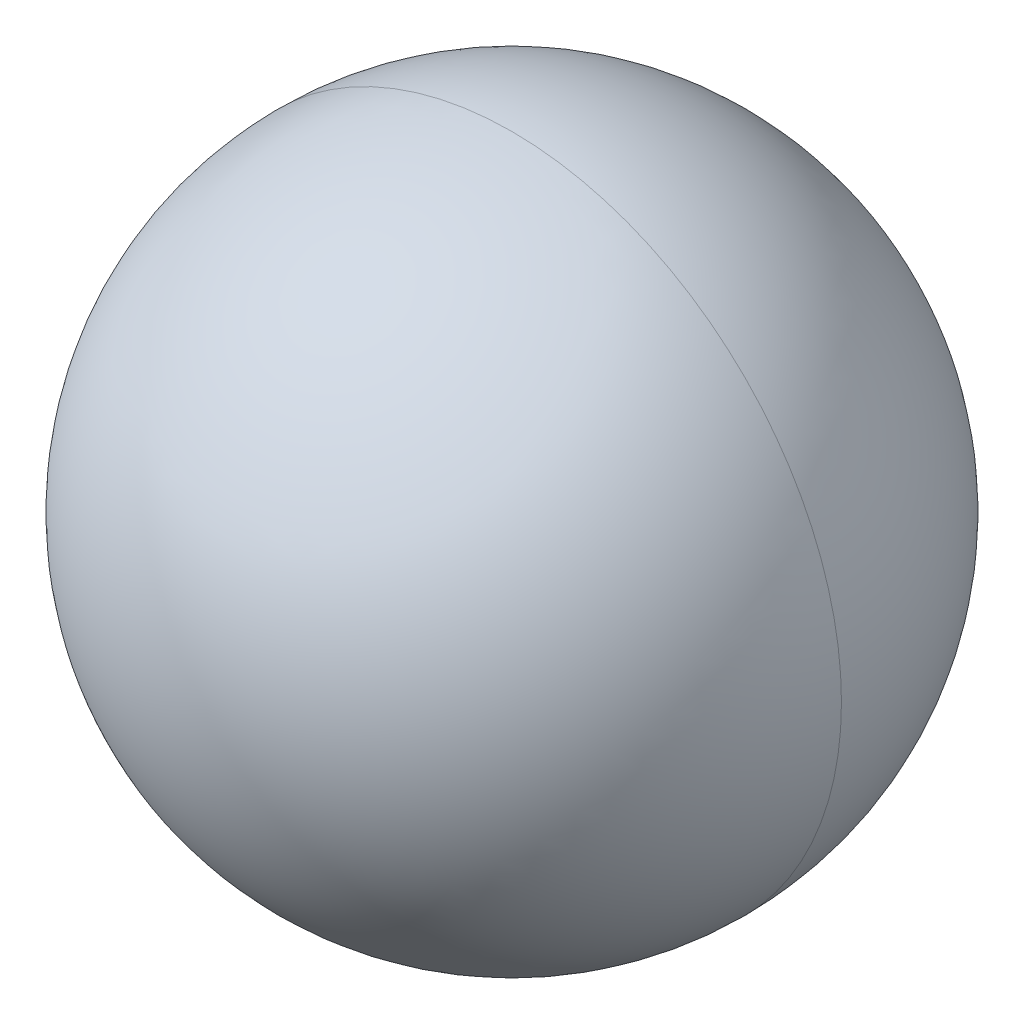
ISO-10303-21;
HEADER;
FILE_DESCRIPTION(('STEP AP214'),'2;1');
FILE_NAME('part.step','',(''),(''),'','','');
FILE_SCHEMA(('AUTOMOTIVE_DESIGN { 1 0 10303 214 1 1 1 1 }'));
ENDSEC;
DATA;
#1=APPLICATION_CONTEXT('core data for automotive mechanical design processes');
#2=APPLICATION_PROTOCOL_DEFINITION('international standard','automotive_design',2000,#1);
#3=PRODUCT_CONTEXT('',#1,'mechanical');
#4=PRODUCT('Part','Part','',(#3));
#5=PRODUCT_RELATED_PRODUCT_CATEGORY('part','',(#4));
#6=PRODUCT_DEFINITION_FORMATION('','',#4);
#7=PRODUCT_DEFINITION_CONTEXT('part definition',#1,'design');
#8=PRODUCT_DEFINITION('design','',#6,#7);
#9=PRODUCT_DEFINITION_SHAPE('','',#8);
#10=(LENGTH_UNIT() NAMED_UNIT(*) SI_UNIT(.MILLI.,.METRE.));
#11=(NAMED_UNIT(*) PLANE_ANGLE_UNIT() SI_UNIT($,.RADIAN.));
#12=(NAMED_UNIT(*) SI_UNIT($,.STERADIAN.) SOLID_ANGLE_UNIT());
#13=UNCERTAINTY_MEASURE_WITH_UNIT(LENGTH_MEASURE(1.E-05),#10,'distance_accuracy_value','');
#14=(GEOMETRIC_REPRESENTATION_CONTEXT(3) GLOBAL_UNCERTAINTY_ASSIGNED_CONTEXT((#13)) GLOBAL_UNIT_ASSIGNED_CONTEXT((#10,
#11,#12)) REPRESENTATION_CONTEXT('',''));
#15=CARTESIAN_POINT('',(0.,0.,0.));
#16=DIRECTION('',(0.,0.,1.));
#17=DIRECTION('',(1.,0.,0.));
#18=AXIS2_PLACEMENT_3D('',#15,#16,#17);
#19=CARTESIAN_POINT('',(-0.2,-0.2,0.135));
#20=DIRECTION('',(0.,0.,-1.));
#21=DIRECTION('',(1.,0.,0.));
#22=AXIS2_PLACEMENT_3D('',#19,#20,#21);
#23=SPHERICAL_SURFACE('',#22,0.135);
#24=CARTESIAN_POINT('',(-0.2,-0.2,0.135));
#25=DIRECTION('',(0.,0.,1.));
#26=DIRECTION('',(1.,0.,0.));
#27=AXIS2_PLACEMENT_3D('',#24,#25,#26);
#28=CIRCLE('',#27,0.135);
#29=CARTESIAN_POINT('',(-0.065,-0.2,0.135));
#30=VERTEX_POINT('',#29);
#31=CARTESIAN_POINT('',(-0.2,-0.065,0.135));
#32=VERTEX_POINT('',#31);
#33=EDGE_CURVE('E11',#30,#32,#28,.T.);
#34=ORIENTED_EDGE('',*,*,#33,.F.);
#35=CARTESIAN_POINT('',(-0.065,-0.2,0.135));
#36=CARTESIAN_POINT('',(-0.0649999999999998,-0.199999999999999,0.0925884991765377));
#37=CARTESIAN_POINT('',(-0.0816070255461748,-0.200000000000001,0.0501374281460087));
#38=CARTESIAN_POINT('',(-0.115137428146008,-0.2,0.0166070255461743));
#39=CARTESIAN_POINT('',(-0.157588499176538,-0.2,0.));
#40=CARTESIAN_POINT('',(-0.2,-0.2,0.));
#41=B_SPLINE_CURVE_WITH_KNOTS('',5,(#35,#36,#37,#38,#39,#40),.UNSPECIFIED.,.F.,.F.,(6,6),(0.,
1.5707963267949),.UNSPECIFIED.);
#42=CARTESIAN_POINT('',(-0.2,-0.2,0.));
#43=VERTEX_POINT('',#42);
#44=EDGE_CURVE('E24',#30,#43,#41,.T.);
#45=ORIENTED_EDGE('',*,*,#44,.T.);
#46=ORIENTED_EDGE('',*,*,#44,.F.);
#47=CARTESIAN_POINT('',(-0.2,-0.335,0.135));
#48=VERTEX_POINT('',#47);
#49=EDGE_CURVE('E25',#48,#30,#28,.T.);
#50=ORIENTED_EDGE('',*,*,#49,.F.);
#51=CARTESIAN_POINT('',(-0.2,-0.2,0.135));
#52=DIRECTION('',(0.,0.,-1.));
#53=DIRECTION('',(-1.,0.,0.));
#54=AXIS2_PLACEMENT_3D('',#51,#52,#53);
#55=CIRCLE('',#54,0.135);
#56=EDGE_CURVE('E46',#48,#32,#55,.T.);
#57=ORIENTED_EDGE('',*,*,#56,.T.);
#58=EDGE_LOOP('',(#34,#45,#46,#50,#57));
#59=FACE_BOUND('',#58,.T.);
#60=ADVANCED_FACE('F17',(#59),#23,.T.);
#61=CARTESIAN_POINT('',(-0.2,-0.2,0.135));
#62=DIRECTION('',(0.,0.,-1.));
#63=DIRECTION('',(1.,0.,0.));
#64=AXIS2_PLACEMENT_3D('',#61,#62,#63);
#65=SPHERICAL_SURFACE('',#64,0.135);
#66=ORIENTED_EDGE('',*,*,#56,.F.);
#67=ORIENTED_EDGE('',*,*,#49,.T.);
#68=CARTESIAN_POINT('',(-0.2,-0.2,0.27));
#69=CARTESIAN_POINT('',(-0.157588499176538,-0.200000000000001,0.270000000000001));
#70=CARTESIAN_POINT('',(-0.115137428146008,-0.199999999999999,0.253392974453824));
#71=CARTESIAN_POINT('',(-0.0816070255461746,-0.200000000000001,0.219862571853992));
#72=CARTESIAN_POINT('',(-0.0649999999999999,-0.2,0.177411500823462));
#73=CARTESIAN_POINT('',(-0.065,-0.2,0.135));
#74=B_SPLINE_CURVE_WITH_KNOTS('',5,(#68,#69,#70,#71,#72,#73),.UNSPECIFIED.,.F.,.F.,(6,6),
(-1.5707963267949,0.),.UNSPECIFIED.);
#75=CARTESIAN_POINT('',(-0.2,-0.2,0.27));
#76=VERTEX_POINT('',#75);
#77=EDGE_CURVE('E44',#76,#30,#74,.T.);
#78=ORIENTED_EDGE('',*,*,#77,.F.);
#79=ORIENTED_EDGE('',*,*,#77,.T.);
#80=ORIENTED_EDGE('',*,*,#33,.T.);
#81=EDGE_LOOP('',(#66,#67,#78,#79,#80));
#82=FACE_BOUND('',#81,.T.);
#83=ADVANCED_FACE('F45',(#82),#65,.T.);
#84=CLOSED_SHELL('',(#60,#83));
#85=MANIFOLD_SOLID_BREP('B1',#84);
#86=ADVANCED_BREP_SHAPE_REPRESENTATION('',(#18,#85),#14);
#87=SHAPE_DEFINITION_REPRESENTATION(#9,#86);
ENDSEC;
END-ISO-10303-21;
